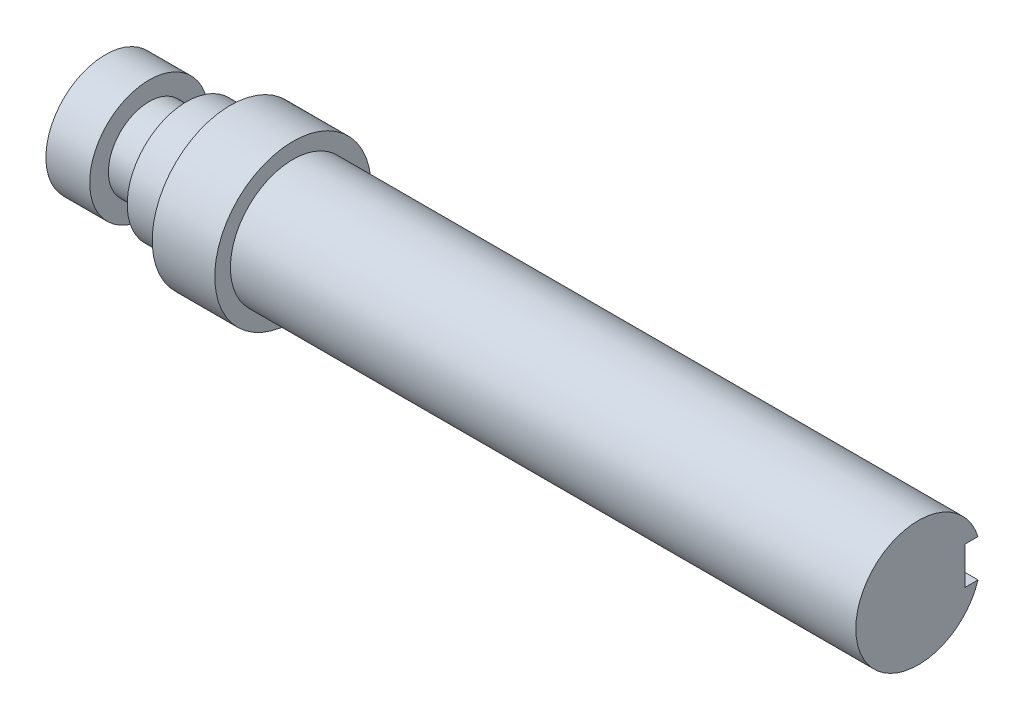
ISO-10303-21;
HEADER;
FILE_DESCRIPTION(('STEP AP214'),'2;1');
FILE_NAME('part.step','',(''),(''),'','','');
FILE_SCHEMA(('AUTOMOTIVE_DESIGN { 1 0 10303 214 1 1 1 1 }'));
ENDSEC;
DATA;
#1=APPLICATION_CONTEXT('core data for automotive mechanical design processes');
#2=APPLICATION_PROTOCOL_DEFINITION('international standard','automotive_design',2000,#1);
#3=PRODUCT_CONTEXT('',#1,'mechanical');
#4=PRODUCT('Part','Part','',(#3));
#5=PRODUCT_RELATED_PRODUCT_CATEGORY('part','',(#4));
#6=PRODUCT_DEFINITION_FORMATION('','',#4);
#7=PRODUCT_DEFINITION_CONTEXT('part definition',#1,'design');
#8=PRODUCT_DEFINITION('design','',#6,#7);
#9=PRODUCT_DEFINITION_SHAPE('','',#8);
#10=(LENGTH_UNIT() NAMED_UNIT(*) SI_UNIT(.MILLI.,.METRE.));
#11=(NAMED_UNIT(*) PLANE_ANGLE_UNIT() SI_UNIT($,.RADIAN.));
#12=(NAMED_UNIT(*) SI_UNIT($,.STERADIAN.) SOLID_ANGLE_UNIT());
#13=UNCERTAINTY_MEASURE_WITH_UNIT(LENGTH_MEASURE(1.E-05),#10,'distance_accuracy_value','');
#14=(GEOMETRIC_REPRESENTATION_CONTEXT(3) GLOBAL_UNCERTAINTY_ASSIGNED_CONTEXT((#13)) GLOBAL_UNIT_ASSIGNED_CONTEXT((#10,
#11,#12)) REPRESENTATION_CONTEXT('',''));
#15=CARTESIAN_POINT('',(0.,0.,0.));
#16=DIRECTION('',(0.,0.,1.));
#17=DIRECTION('',(1.,0.,0.));
#18=AXIS2_PLACEMENT_3D('',#15,#16,#17);
#19=CARTESIAN_POINT('',(0.,10.,0.));
#20=DIRECTION('',(1.,0.,0.));
#21=DIRECTION('',(0.,0.,-1.));
#22=AXIS2_PLACEMENT_3D('',#19,#20,#21);
#23=PLANE('',#22);
#24=DIRECTION('',(0.,1.,0.));
#25=VECTOR('',#24,1.);
#26=CARTESIAN_POINT('',(0.,-3.,-7.5));
#27=LINE('',#26,#25);
#28=CARTESIAN_POINT('',(0.,-3.,-7.5));
#29=VERTEX_POINT('',#28);
#30=CARTESIAN_POINT('',(0.,3.,-7.5));
#31=VERTEX_POINT('',#30);
#32=EDGE_CURVE('E134',#29,#31,#27,.T.);
#33=ORIENTED_EDGE('',*,*,#32,.T.);
#34=DIRECTION('',(0.,0.,-1.));
#35=VECTOR('',#34,1.);
#36=CARTESIAN_POINT('',(0.,3.,-7.5));
#37=LINE('',#36,#35);
#38=CARTESIAN_POINT('',(0.,3.,-9.53939201416946));
#39=VERTEX_POINT('',#38);
#40=EDGE_CURVE('E92',#31,#39,#37,.T.);
#41=ORIENTED_EDGE('',*,*,#40,.T.);
#42=CARTESIAN_POINT('',(0.,0.,0.));
#43=DIRECTION('',(1.,0.,0.));
#44=DIRECTION('',(0.,0.,-1.));
#45=AXIS2_PLACEMENT_3D('',#42,#43,#44);
#46=CIRCLE('',#45,10.);
#47=CARTESIAN_POINT('',(0.,-3.,-9.53939201416946));
#48=VERTEX_POINT('',#47);
#49=EDGE_CURVE('E127',#39,#48,#46,.T.);
#50=ORIENTED_EDGE('',*,*,#49,.T.);
#51=DIRECTION('',(0.,0.,-1.));
#52=VECTOR('',#51,1.);
#53=CARTESIAN_POINT('',(0.,-3.,-7.5));
#54=LINE('',#53,#52);
#55=EDGE_CURVE('E51',#29,#48,#54,.T.);
#56=ORIENTED_EDGE('',*,*,#55,.F.);
#57=EDGE_LOOP('',(#33,#41,#50,#56));
#58=FACE_BOUND('',#57,.T.);
#59=ADVANCED_FACE('F37',(#58),#23,.T.);
#60=CARTESIAN_POINT('',(0.,0.,0.));
#61=DIRECTION('',(1.,0.,0.));
#62=DIRECTION('',(0.,0.,-1.));
#63=AXIS2_PLACEMENT_3D('',#60,#61,#62);
#64=CYLINDRICAL_SURFACE('',#63,10.);
#65=CARTESIAN_POINT('',(-100.,0.,0.));
#66=DIRECTION('',(1.,0.,0.));
#67=DIRECTION('',(0.,0.,-1.));
#68=AXIS2_PLACEMENT_3D('',#65,#66,#67);
#69=CIRCLE('',#68,10.);
#70=CARTESIAN_POINT('',(-100.,0.,-10.));
#71=VERTEX_POINT('',#70);
#72=EDGE_CURVE('E124',#71,#71,#69,.T.);
#73=ORIENTED_EDGE('',*,*,#72,.T.);
#74=EDGE_LOOP('',(#73));
#75=FACE_BOUND('',#74,.T.);
#76=CARTESIAN_POINT('',(-20.,0.,0.));
#77=DIRECTION('',(1.,0.,0.));
#78=DIRECTION('',(0.,0.,-1.));
#79=AXIS2_PLACEMENT_3D('',#76,#77,#78);
#80=CIRCLE('',#79,10.);
#81=CARTESIAN_POINT('',(-20.,3.,-9.53939201416946));
#82=VERTEX_POINT('',#81);
#83=CARTESIAN_POINT('',(-20.,-3.00000000000001,-9.53939201416946));
#84=VERTEX_POINT('',#83);
#85=EDGE_CURVE('E58',#82,#84,#80,.F.);
#86=ORIENTED_EDGE('',*,*,#85,.T.);
#87=DIRECTION('',(1.,0.,0.));
#88=VECTOR('',#87,1.);
#89=CARTESIAN_POINT('',(0.,-3.,-9.53939201416946));
#90=LINE('',#89,#88);
#91=EDGE_CURVE('E11',#84,#48,#90,.T.);
#92=ORIENTED_EDGE('',*,*,#91,.T.);
#93=ORIENTED_EDGE('',*,*,#49,.F.);
#94=DIRECTION('',(1.,0.,0.));
#95=VECTOR('',#94,1.);
#96=CARTESIAN_POINT('',(0.,3.,-9.53939201416946));
#97=LINE('',#96,#95);
#98=EDGE_CURVE('E44',#39,#82,#97,.F.);
#99=ORIENTED_EDGE('',*,*,#98,.T.);
#100=EDGE_LOOP('',(#86,#92,#93,#99));
#101=FACE_BOUND('',#100,.T.);
#102=ADVANCED_FACE('F132',(#75,#101),#64,.T.);
#103=CARTESIAN_POINT('',(-100.,10.,0.));
#104=DIRECTION('',(1.,0.,0.));
#105=DIRECTION('',(0.,0.,-1.));
#106=AXIS2_PLACEMENT_3D('',#103,#104,#105);
#107=PLANE('',#106);
#108=CARTESIAN_POINT('',(-100.,0.,0.));
#109=DIRECTION('',(1.,0.,0.));
#110=DIRECTION('',(0.,0.,-1.));
#111=AXIS2_PLACEMENT_3D('',#108,#109,#110);
#112=CIRCLE('',#111,12.5);
#113=CARTESIAN_POINT('',(-100.,0.,-12.5));
#114=VERTEX_POINT('',#113);
#115=EDGE_CURVE('E121',#114,#114,#112,.T.);
#116=ORIENTED_EDGE('',*,*,#115,.T.);
#117=EDGE_LOOP('',(#116));
#118=FACE_BOUND('',#117,.T.);
#119=ORIENTED_EDGE('',*,*,#72,.F.);
#120=EDGE_LOOP('',(#119));
#121=FACE_BOUND('',#120,.T.);
#122=ADVANCED_FACE('F151',(#118,#121),#107,.T.);
#123=CARTESIAN_POINT('',(0.,0.,0.));
#124=DIRECTION('',(1.,0.,0.));
#125=DIRECTION('',(0.,0.,-1.));
#126=AXIS2_PLACEMENT_3D('',#123,#124,#125);
#127=CYLINDRICAL_SURFACE('',#126,12.5);
#128=CARTESIAN_POINT('',(-110.,0.,0.));
#129=DIRECTION('',(1.,0.,0.));
#130=DIRECTION('',(0.,0.,-1.));
#131=AXIS2_PLACEMENT_3D('',#128,#129,#130);
#132=CIRCLE('',#131,12.5);
#133=CARTESIAN_POINT('',(-110.,0.,-12.5));
#134=VERTEX_POINT('',#133);
#135=EDGE_CURVE('E118',#134,#134,#132,.T.);
#136=ORIENTED_EDGE('',*,*,#135,.T.);
#137=EDGE_LOOP('',(#136));
#138=FACE_BOUND('',#137,.T.);
#139=ORIENTED_EDGE('',*,*,#115,.F.);
#140=EDGE_LOOP('',(#139));
#141=FACE_BOUND('',#140,.T.);
#142=ADVANCED_FACE('F156',(#138,#141),#127,.T.);
#143=CARTESIAN_POINT('',(-110.,12.5,0.));
#144=DIRECTION('',(-1.,0.,0.));
#145=DIRECTION('',(0.,0.,1.));
#146=AXIS2_PLACEMENT_3D('',#143,#144,#145);
#147=PLANE('',#146);
#148=CARTESIAN_POINT('',(-110.,0.,0.));
#149=DIRECTION('',(1.,0.,0.));
#150=DIRECTION('',(0.,0.,-1.));
#151=AXIS2_PLACEMENT_3D('',#148,#149,#150);
#152=CIRCLE('',#151,9.49999999999999);
#153=CARTESIAN_POINT('',(-110.,0.,-9.49999999999999));
#154=VERTEX_POINT('',#153);
#155=EDGE_CURVE('E115',#154,#154,#152,.T.);
#156=ORIENTED_EDGE('',*,*,#155,.T.);
#157=EDGE_LOOP('',(#156));
#158=FACE_BOUND('',#157,.T.);
#159=ORIENTED_EDGE('',*,*,#135,.F.);
#160=EDGE_LOOP('',(#159));
#161=FACE_BOUND('',#160,.T.);
#162=ADVANCED_FACE('F162',(#158,#161),#147,.T.);
#163=CARTESIAN_POINT('',(0.,0.,0.));
#164=DIRECTION('',(1.,0.,0.));
#165=DIRECTION('',(0.,0.,-1.));
#166=AXIS2_PLACEMENT_3D('',#163,#164,#165);
#167=CYLINDRICAL_SURFACE('',#166,9.49999999999998);
#168=CARTESIAN_POINT('',(-117.,0.,0.));
#169=DIRECTION('',(1.,0.,0.));
#170=DIRECTION('',(0.,0.,-1.));
#171=AXIS2_PLACEMENT_3D('',#168,#169,#170);
#172=CIRCLE('',#171,9.49999999999998);
#173=CARTESIAN_POINT('',(-117.,0.,-9.49999999999998));
#174=VERTEX_POINT('',#173);
#175=EDGE_CURVE('E112',#174,#174,#172,.T.);
#176=ORIENTED_EDGE('',*,*,#175,.T.);
#177=EDGE_LOOP('',(#176));
#178=FACE_BOUND('',#177,.T.);
#179=ORIENTED_EDGE('',*,*,#155,.F.);
#180=EDGE_LOOP('',(#179));
#181=FACE_BOUND('',#180,.T.);
#182=ADVANCED_FACE('F166',(#178,#181),#167,.T.);
#183=CARTESIAN_POINT('',(-117.,9.49999999999998,0.));
#184=DIRECTION('',(-1.,0.,0.));
#185=DIRECTION('',(0.,0.,1.));
#186=AXIS2_PLACEMENT_3D('',#183,#184,#185);
#187=PLANE('',#186);
#188=CARTESIAN_POINT('',(-117.,0.,0.));
#189=DIRECTION('',(1.,0.,0.));
#190=DIRECTION('',(0.,0.,-1.));
#191=AXIS2_PLACEMENT_3D('',#188,#189,#190);
#192=CIRCLE('',#191,6.49999999999999);
#193=CARTESIAN_POINT('',(-117.,0.,-6.49999999999999));
#194=VERTEX_POINT('',#193);
#195=EDGE_CURVE('E109',#194,#194,#192,.T.);
#196=ORIENTED_EDGE('',*,*,#195,.T.);
#197=EDGE_LOOP('',(#196));
#198=FACE_BOUND('',#197,.T.);
#199=ORIENTED_EDGE('',*,*,#175,.F.);
#200=EDGE_LOOP('',(#199));
#201=FACE_BOUND('',#200,.T.);
#202=ADVANCED_FACE('F170',(#198,#201),#187,.T.);
#203=CARTESIAN_POINT('',(0.,0.,0.));
#204=DIRECTION('',(1.,0.,0.));
#205=DIRECTION('',(0.,0.,-1.));
#206=AXIS2_PLACEMENT_3D('',#203,#204,#205);
#207=CYLINDRICAL_SURFACE('',#206,6.49999999999999);
#208=CARTESIAN_POINT('',(-123.,0.,0.));
#209=DIRECTION('',(1.,0.,0.));
#210=DIRECTION('',(0.,0.,-1.));
#211=AXIS2_PLACEMENT_3D('',#208,#209,#210);
#212=CIRCLE('',#211,6.49999999999999);
#213=CARTESIAN_POINT('',(-123.,0.,-6.49999999999999));
#214=VERTEX_POINT('',#213);
#215=EDGE_CURVE('E106',#214,#214,#212,.T.);
#216=ORIENTED_EDGE('',*,*,#215,.T.);
#217=EDGE_LOOP('',(#216));
#218=FACE_BOUND('',#217,.T.);
#219=ORIENTED_EDGE('',*,*,#195,.F.);
#220=EDGE_LOOP('',(#219));
#221=FACE_BOUND('',#220,.T.);
#222=ADVANCED_FACE('F174',(#218,#221),#207,.T.);
#223=CARTESIAN_POINT('',(-123.,6.49999999999999,0.));
#224=DIRECTION('',(1.,0.,0.));
#225=DIRECTION('',(0.,0.,-1.));
#226=AXIS2_PLACEMENT_3D('',#223,#224,#225);
#227=PLANE('',#226);
#228=CARTESIAN_POINT('',(-123.,0.,0.));
#229=DIRECTION('',(1.,0.,0.));
#230=DIRECTION('',(0.,0.,-1.));
#231=AXIS2_PLACEMENT_3D('',#228,#229,#230);
#232=CIRCLE('',#231,9.49999999999998);
#233=CARTESIAN_POINT('',(-123.,0.,-9.49999999999998));
#234=VERTEX_POINT('',#233);
#235=EDGE_CURVE('E99',#234,#234,#232,.T.);
#236=ORIENTED_EDGE('',*,*,#235,.T.);
#237=EDGE_LOOP('',(#236));
#238=FACE_BOUND('',#237,.T.);
#239=ORIENTED_EDGE('',*,*,#215,.F.);
#240=EDGE_LOOP('',(#239));
#241=FACE_BOUND('',#240,.T.);
#242=ADVANCED_FACE('F178',(#238,#241),#227,.T.);
#243=CARTESIAN_POINT('',(0.,0.,0.));
#244=DIRECTION('',(1.,0.,0.));
#245=DIRECTION('',(0.,0.,-1.));
#246=AXIS2_PLACEMENT_3D('',#243,#244,#245);
#247=CYLINDRICAL_SURFACE('',#246,9.49999999999998);
#248=CARTESIAN_POINT('',(-130.,0.,0.));
#249=DIRECTION('',(1.,0.,0.));
#250=DIRECTION('',(0.,0.,-1.));
#251=AXIS2_PLACEMENT_3D('',#248,#249,#250);
#252=CIRCLE('',#251,9.49999999999998);
#253=CARTESIAN_POINT('',(-130.,0.,-9.49999999999998));
#254=VERTEX_POINT('',#253);
#255=EDGE_CURVE('E95',#254,#254,#252,.T.);
#256=ORIENTED_EDGE('',*,*,#255,.T.);
#257=EDGE_LOOP('',(#256));
#258=FACE_BOUND('',#257,.T.);
#259=ORIENTED_EDGE('',*,*,#235,.F.);
#260=EDGE_LOOP('',(#259));
#261=FACE_BOUND('',#260,.T.);
#262=ADVANCED_FACE('F182',(#258,#261),#247,.T.);
#263=CARTESIAN_POINT('',(-130.,9.49999999999998,0.));
#264=DIRECTION('',(-1.,0.,0.));
#265=DIRECTION('',(0.,0.,1.));
#266=AXIS2_PLACEMENT_3D('',#263,#264,#265);
#267=PLANE('',#266);
#268=ORIENTED_EDGE('',*,*,#255,.F.);
#269=EDGE_LOOP('',(#268));
#270=FACE_BOUND('',#269,.T.);
#271=ADVANCED_FACE('F186',(#270),#267,.T.);
#272=CARTESIAN_POINT('',(-20.,3.,-7.5));
#273=DIRECTION('',(0.,-1.,0.));
#274=DIRECTION('',(0.,0.,-1.));
#275=AXIS2_PLACEMENT_3D('',#272,#273,#274);
#276=PLANE('',#275);
#277=ORIENTED_EDGE('',*,*,#40,.F.);
#278=DIRECTION('',(-1.,0.,0.));
#279=VECTOR('',#278,1.);
#280=CARTESIAN_POINT('',(-20.,3.,-7.5));
#281=LINE('',#280,#279);
#282=CARTESIAN_POINT('',(-20.,3.,-7.5));
#283=VERTEX_POINT('',#282);
#284=EDGE_CURVE('E82',#31,#283,#281,.T.);
#285=ORIENTED_EDGE('',*,*,#284,.T.);
#286=DIRECTION('',(0.,0.,-1.));
#287=VECTOR('',#286,1.);
#288=CARTESIAN_POINT('',(-20.,3.,-7.5));
#289=LINE('',#288,#287);
#290=EDGE_CURVE('E89',#283,#82,#289,.T.);
#291=ORIENTED_EDGE('',*,*,#290,.T.);
#292=ORIENTED_EDGE('',*,*,#98,.F.);
#293=EDGE_LOOP('',(#277,#285,#291,#292));
#294=FACE_BOUND('',#293,.T.);
#295=ADVANCED_FACE('F88',(#294),#276,.T.);
#296=CARTESIAN_POINT('',(-20.,-3.00000000000001,-7.5));
#297=DIRECTION('',(1.,0.,0.));
#298=DIRECTION('',(0.,0.,-1.));
#299=AXIS2_PLACEMENT_3D('',#296,#297,#298);
#300=PLANE('',#299);
#301=ORIENTED_EDGE('',*,*,#85,.F.);
#302=ORIENTED_EDGE('',*,*,#290,.F.);
#303=DIRECTION('',(0.,-1.,0.));
#304=VECTOR('',#303,1.);
#305=CARTESIAN_POINT('',(-20.,-3.00000000000001,-7.5));
#306=LINE('',#305,#304);
#307=CARTESIAN_POINT('',(-20.,-3.00000000000001,-7.5));
#308=VERTEX_POINT('',#307);
#309=EDGE_CURVE('E78',#283,#308,#306,.T.);
#310=ORIENTED_EDGE('',*,*,#309,.T.);
#311=DIRECTION('',(0.,0.,-1.));
#312=VECTOR('',#311,1.);
#313=CARTESIAN_POINT('',(-20.,-3.00000000000001,-7.5));
#314=LINE('',#313,#312);
#315=EDGE_CURVE('E96',#308,#84,#314,.T.);
#316=ORIENTED_EDGE('',*,*,#315,.T.);
#317=EDGE_LOOP('',(#301,#302,#310,#316));
#318=FACE_BOUND('',#317,.T.);
#319=ADVANCED_FACE('F94',(#318),#300,.T.);
#320=CARTESIAN_POINT('',(0.,-3.,-7.5));
#321=DIRECTION('',(0.,1.,0.));
#322=DIRECTION('',(-1.,0.,0.));
#323=AXIS2_PLACEMENT_3D('',#320,#321,#322);
#324=PLANE('',#323);
#325=ORIENTED_EDGE('',*,*,#315,.F.);
#326=DIRECTION('',(1.,0.,0.));
#327=VECTOR('',#326,1.);
#328=CARTESIAN_POINT('',(0.,-3.,-7.5));
#329=LINE('',#328,#327);
#330=EDGE_CURVE('E84',#308,#29,#329,.T.);
#331=ORIENTED_EDGE('',*,*,#330,.T.);
#332=ORIENTED_EDGE('',*,*,#55,.T.);
#333=ORIENTED_EDGE('',*,*,#91,.F.);
#334=EDGE_LOOP('',(#325,#331,#332,#333));
#335=FACE_BOUND('',#334,.T.);
#336=ADVANCED_FACE('F138',(#335),#324,.T.);
#337=CARTESIAN_POINT('',(0.,0.,-7.5));
#338=DIRECTION('',(0.,0.,1.));
#339=DIRECTION('',(1.,0.,0.));
#340=AXIS2_PLACEMENT_3D('',#337,#338,#339);
#341=PLANE('',#340);
#342=ORIENTED_EDGE('',*,*,#284,.F.);
#343=ORIENTED_EDGE('',*,*,#32,.F.);
#344=ORIENTED_EDGE('',*,*,#330,.F.);
#345=ORIENTED_EDGE('',*,*,#309,.F.);
#346=EDGE_LOOP('',(#342,#343,#344,#345));
#347=FACE_BOUND('',#346,.T.);
#348=ADVANCED_FACE('F80',(#347),#341,.F.);
#349=CLOSED_SHELL('',(#59,#102,#122,#142,#162,#182,#202,#222,#242,#262,#271,#295,#319,#336,#348));
#350=MANIFOLD_SOLID_BREP('B2',#349);
#351=ADVANCED_BREP_SHAPE_REPRESENTATION('',(#18,#350),#14);
#352=SHAPE_DEFINITION_REPRESENTATION(#9,#351);
ENDSEC;
END-ISO-10303-21;
